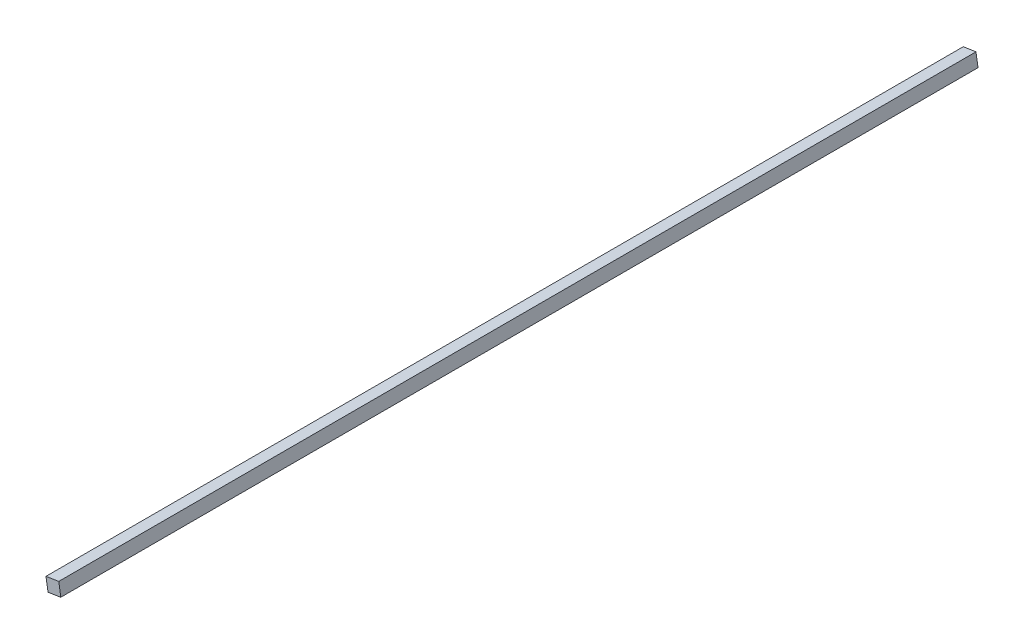
ISO-10303-21;
HEADER;
FILE_DESCRIPTION(('STEP AP214'),'2;1');
FILE_NAME('part.step','',(''),(''),'','','');
FILE_SCHEMA(('AUTOMOTIVE_DESIGN { 1 0 10303 214 1 1 1 1 }'));
ENDSEC;
DATA;
#1=APPLICATION_CONTEXT('core data for automotive mechanical design processes');
#2=APPLICATION_PROTOCOL_DEFINITION('international standard','automotive_design',2000,#1);
#3=PRODUCT_CONTEXT('',#1,'mechanical');
#4=PRODUCT('Part','Part','',(#3));
#5=PRODUCT_RELATED_PRODUCT_CATEGORY('part','',(#4));
#6=PRODUCT_DEFINITION_FORMATION('','',#4);
#7=PRODUCT_DEFINITION_CONTEXT('part definition',#1,'design');
#8=PRODUCT_DEFINITION('design','',#6,#7);
#9=PRODUCT_DEFINITION_SHAPE('','',#8);
#10=(LENGTH_UNIT() NAMED_UNIT(*) SI_UNIT(.MILLI.,.METRE.));
#11=(NAMED_UNIT(*) PLANE_ANGLE_UNIT() SI_UNIT($,.RADIAN.));
#12=(NAMED_UNIT(*) SI_UNIT($,.STERADIAN.) SOLID_ANGLE_UNIT());
#13=UNCERTAINTY_MEASURE_WITH_UNIT(LENGTH_MEASURE(1.E-05),#10,'distance_accuracy_value','');
#14=(GEOMETRIC_REPRESENTATION_CONTEXT(3) GLOBAL_UNCERTAINTY_ASSIGNED_CONTEXT((#13)) GLOBAL_UNIT_ASSIGNED_CONTEXT((#10,
#11,#12)) REPRESENTATION_CONTEXT('',''));
#15=CARTESIAN_POINT('',(0.,0.,0.));
#16=DIRECTION('',(0.,0.,1.));
#17=DIRECTION('',(1.,0.,0.));
#18=AXIS2_PLACEMENT_3D('',#15,#16,#17);
#19=CARTESIAN_POINT('',(-1.19375345238939,-1.63624654761061,203.2));
#20=DIRECTION('',(-0.15448102471478,0.987995755559239,0.));
#21=DIRECTION('',(-0.987995755559239,-0.15448102471478,0.));
#22=AXIS2_PLACEMENT_3D('',#19,#20,#21);
#23=PLANE('',#22);
#24=DIRECTION('',(0.987995755559239,0.15448102471478,0.));
#25=VECTOR('',#24,1.);
#26=CARTESIAN_POINT('',(-1.19375345238939,-1.63624654761061,0.));
#27=LINE('',#26,#25);
#28=CARTESIAN_POINT('',(-1.19375345238939,-1.63624654761061,0.));
#29=VERTEX_POINT('',#28);
#30=CARTESIAN_POINT('',(1.63624654761061,-1.19375345238939,0.));
#31=VERTEX_POINT('',#30);
#32=EDGE_CURVE('E102',#29,#31,#27,.T.);
#33=ORIENTED_EDGE('',*,*,#32,.T.);
#34=DIRECTION('',(0.,0.,-1.));
#35=VECTOR('',#34,1.);
#36=CARTESIAN_POINT('',(1.63624654761061,-1.19375345238939,203.2));
#37=LINE('',#36,#35);
#38=CARTESIAN_POINT('',(1.63624654761061,-1.19375345238939,203.2));
#39=VERTEX_POINT('',#38);
#40=EDGE_CURVE('E11',#39,#31,#37,.T.);
#41=ORIENTED_EDGE('',*,*,#40,.F.);
#42=DIRECTION('',(0.987995755559239,0.15448102471478,0.));
#43=VECTOR('',#42,1.);
#44=CARTESIAN_POINT('',(-1.19375345238939,-1.63624654761061,203.2));
#45=LINE('',#44,#43);
#46=CARTESIAN_POINT('',(-1.19375345238939,-1.63624654761061,203.2));
#47=VERTEX_POINT('',#46);
#48=EDGE_CURVE('E90',#47,#39,#45,.T.);
#49=ORIENTED_EDGE('',*,*,#48,.F.);
#50=DIRECTION('',(0.,0.,-1.));
#51=VECTOR('',#50,1.);
#52=CARTESIAN_POINT('',(-1.19375345238939,-1.63624654761061,203.2));
#53=LINE('',#52,#51);
#54=EDGE_CURVE('E98',#47,#29,#53,.T.);
#55=ORIENTED_EDGE('',*,*,#54,.T.);
#56=EDGE_LOOP('',(#33,#41,#49,#55));
#57=FACE_BOUND('',#56,.T.);
#58=ADVANCED_FACE('F39',(#57),#23,.F.);
#59=CARTESIAN_POINT('',(1.63624654761061,-1.19375345238939,203.2));
#60=DIRECTION('',(-0.987995755559239,-0.154481024714779,0.));
#61=DIRECTION('',(0.154481024714779,-0.987995755559239,0.));
#62=AXIS2_PLACEMENT_3D('',#59,#60,#61);
#63=PLANE('',#62);
#64=DIRECTION('',(-0.154481024714779,0.987995755559239,0.));
#65=VECTOR('',#64,1.);
#66=CARTESIAN_POINT('',(1.63624654761061,-1.19375345238939,0.));
#67=LINE('',#66,#65);
#68=CARTESIAN_POINT('',(1.19375345238939,1.63624654761061,0.));
#69=VERTEX_POINT('',#68);
#70=EDGE_CURVE('E94',#31,#69,#67,.T.);
#71=ORIENTED_EDGE('',*,*,#70,.T.);
#72=DIRECTION('',(0.,0.,-1.));
#73=VECTOR('',#72,1.);
#74=CARTESIAN_POINT('',(1.19375345238939,1.63624654761061,203.2));
#75=LINE('',#74,#73);
#76=CARTESIAN_POINT('',(1.19375345238939,1.63624654761061,203.2));
#77=VERTEX_POINT('',#76);
#78=EDGE_CURVE('E47',#77,#69,#75,.T.);
#79=ORIENTED_EDGE('',*,*,#78,.F.);
#80=DIRECTION('',(-0.154481024714779,0.987995755559239,0.));
#81=VECTOR('',#80,1.);
#82=CARTESIAN_POINT('',(1.63624654761061,-1.19375345238939,203.2));
#83=LINE('',#82,#81);
#84=EDGE_CURVE('E85',#39,#77,#83,.T.);
#85=ORIENTED_EDGE('',*,*,#84,.F.);
#86=ORIENTED_EDGE('',*,*,#40,.T.);
#87=EDGE_LOOP('',(#71,#79,#85,#86));
#88=FACE_BOUND('',#87,.T.);
#89=ADVANCED_FACE('F93',(#88),#63,.F.);
#90=CARTESIAN_POINT('',(1.19375345238939,1.63624654761061,203.2));
#91=DIRECTION('',(0.15448102471478,-0.987995755559239,0.));
#92=DIRECTION('',(0.987995755559239,0.15448102471478,0.));
#93=AXIS2_PLACEMENT_3D('',#90,#91,#92);
#94=PLANE('',#93);
#95=DIRECTION('',(-0.987995755559239,-0.15448102471478,0.));
#96=VECTOR('',#95,1.);
#97=CARTESIAN_POINT('',(1.19375345238939,1.63624654761061,0.));
#98=LINE('',#97,#96);
#99=CARTESIAN_POINT('',(-1.6362465476106,1.19375345238939,0.));
#100=VERTEX_POINT('',#99);
#101=EDGE_CURVE('E72',#69,#100,#98,.T.);
#102=ORIENTED_EDGE('',*,*,#101,.T.);
#103=DIRECTION('',(0.,0.,-1.));
#104=VECTOR('',#103,1.);
#105=CARTESIAN_POINT('',(-1.6362465476106,1.19375345238939,203.2));
#106=LINE('',#105,#104);
#107=CARTESIAN_POINT('',(-1.6362465476106,1.19375345238939,203.2));
#108=VERTEX_POINT('',#107);
#109=EDGE_CURVE('E95',#108,#100,#106,.T.);
#110=ORIENTED_EDGE('',*,*,#109,.F.);
#111=DIRECTION('',(-0.987995755559239,-0.15448102471478,0.));
#112=VECTOR('',#111,1.);
#113=CARTESIAN_POINT('',(1.19375345238939,1.63624654761061,203.2));
#114=LINE('',#113,#112);
#115=EDGE_CURVE('E88',#77,#108,#114,.T.);
#116=ORIENTED_EDGE('',*,*,#115,.F.);
#117=ORIENTED_EDGE('',*,*,#78,.T.);
#118=EDGE_LOOP('',(#102,#110,#116,#117));
#119=FACE_BOUND('',#118,.T.);
#120=ADVANCED_FACE('F96',(#119),#94,.F.);
#121=CARTESIAN_POINT('',(-1.6362465476106,1.19375345238939,203.2));
#122=DIRECTION('',(0.987995755559239,0.154481024714779,0.));
#123=DIRECTION('',(-0.154481024714779,0.987995755559239,0.));
#124=AXIS2_PLACEMENT_3D('',#121,#122,#123);
#125=PLANE('',#124);
#126=DIRECTION('',(0.154481024714779,-0.987995755559239,0.));
#127=VECTOR('',#126,1.);
#128=CARTESIAN_POINT('',(-1.6362465476106,1.19375345238939,0.));
#129=LINE('',#128,#127);
#130=EDGE_CURVE('E78',#100,#29,#129,.T.);
#131=ORIENTED_EDGE('',*,*,#130,.T.);
#132=ORIENTED_EDGE('',*,*,#54,.F.);
#133=DIRECTION('',(0.154481024714779,-0.987995755559239,0.));
#134=VECTOR('',#133,1.);
#135=CARTESIAN_POINT('',(-1.6362465476106,1.19375345238939,203.2));
#136=LINE('',#135,#134);
#137=EDGE_CURVE('E55',#108,#47,#136,.T.);
#138=ORIENTED_EDGE('',*,*,#137,.F.);
#139=ORIENTED_EDGE('',*,*,#109,.T.);
#140=EDGE_LOOP('',(#131,#132,#138,#139));
#141=FACE_BOUND('',#140,.T.);
#142=ADVANCED_FACE('F109',(#141),#125,.F.);
#143=CARTESIAN_POINT('',(0.,0.,203.2));
#144=DIRECTION('',(0.,0.,1.));
#145=DIRECTION('',(1.,0.,0.));
#146=AXIS2_PLACEMENT_3D('',#143,#144,#145);
#147=PLANE('',#146);
#148=ORIENTED_EDGE('',*,*,#48,.T.);
#149=ORIENTED_EDGE('',*,*,#84,.T.);
#150=ORIENTED_EDGE('',*,*,#115,.T.);
#151=ORIENTED_EDGE('',*,*,#137,.T.);
#152=EDGE_LOOP('',(#148,#149,#150,#151));
#153=FACE_BOUND('',#152,.T.);
#154=ADVANCED_FACE('F86',(#153),#147,.T.);
#155=CARTESIAN_POINT('',(0.,0.,0.));
#156=DIRECTION('',(0.,0.,1.));
#157=DIRECTION('',(1.,0.,0.));
#158=AXIS2_PLACEMENT_3D('',#155,#156,#157);
#159=PLANE('',#158);
#160=ORIENTED_EDGE('',*,*,#32,.F.);
#161=ORIENTED_EDGE('',*,*,#130,.F.);
#162=ORIENTED_EDGE('',*,*,#101,.F.);
#163=ORIENTED_EDGE('',*,*,#70,.F.);
#164=EDGE_LOOP('',(#160,#161,#162,#163));
#165=FACE_BOUND('',#164,.T.);
#166=ADVANCED_FACE('F112',(#165),#159,.F.);
#167=CLOSED_SHELL('',(#58,#89,#120,#142,#154,#166));
#168=MANIFOLD_SOLID_BREP('B2',#167);
#169=ADVANCED_BREP_SHAPE_REPRESENTATION('',(#18,#168),#14);
#170=SHAPE_DEFINITION_REPRESENTATION(#9,#169);
ENDSEC;
END-ISO-10303-21;
